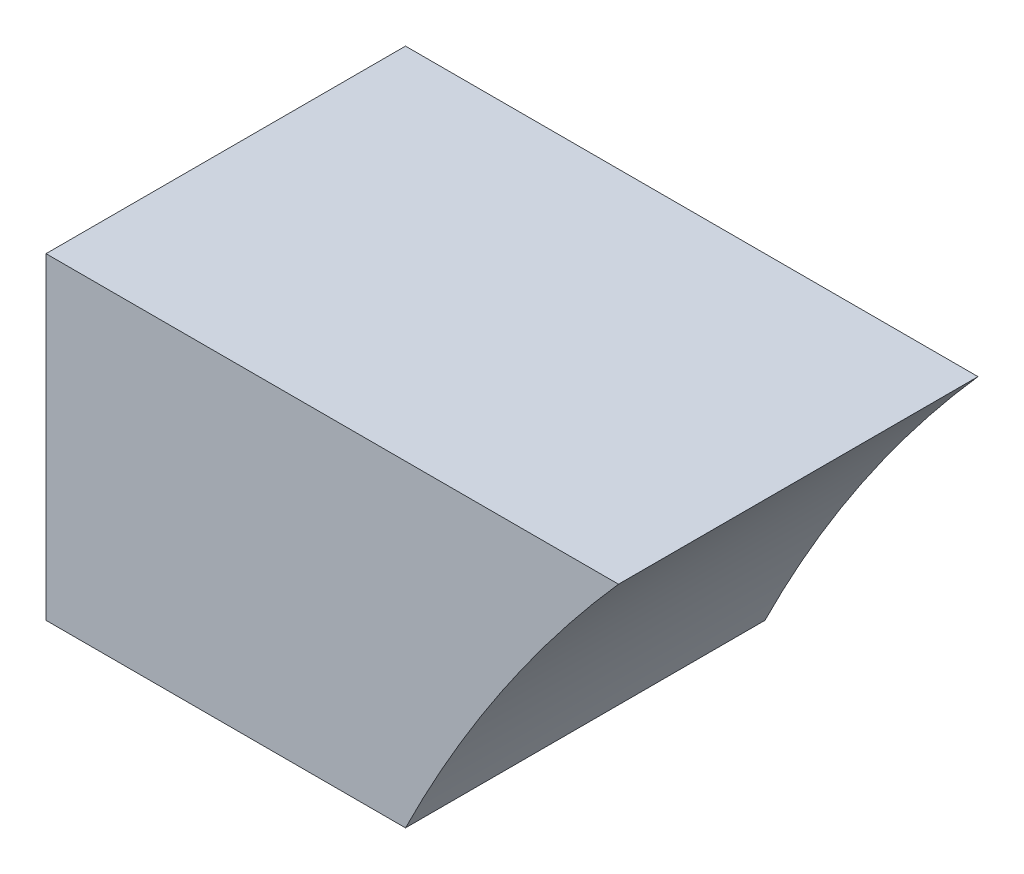
ISO-10303-21;
HEADER;
FILE_DESCRIPTION(('STEP AP214'),'2;1');
FILE_NAME('part.step','',(''),(''),'','','');
FILE_SCHEMA(('AUTOMOTIVE_DESIGN { 1 0 10303 214 1 1 1 1 }'));
ENDSEC;
DATA;
#1=APPLICATION_CONTEXT('core data for automotive mechanical design processes');
#2=APPLICATION_PROTOCOL_DEFINITION('international standard','automotive_design',2000,#1);
#3=PRODUCT_CONTEXT('',#1,'mechanical');
#4=PRODUCT('Part','Part','',(#3));
#5=PRODUCT_RELATED_PRODUCT_CATEGORY('part','',(#4));
#6=PRODUCT_DEFINITION_FORMATION('','',#4);
#7=PRODUCT_DEFINITION_CONTEXT('part definition',#1,'design');
#8=PRODUCT_DEFINITION('design','',#6,#7);
#9=PRODUCT_DEFINITION_SHAPE('','',#8);
#10=(LENGTH_UNIT() NAMED_UNIT(*) SI_UNIT(.MILLI.,.METRE.));
#11=(NAMED_UNIT(*) PLANE_ANGLE_UNIT() SI_UNIT($,.RADIAN.));
#12=(NAMED_UNIT(*) SI_UNIT($,.STERADIAN.) SOLID_ANGLE_UNIT());
#13=UNCERTAINTY_MEASURE_WITH_UNIT(LENGTH_MEASURE(1.E-05),#10,'distance_accuracy_value','');
#14=(GEOMETRIC_REPRESENTATION_CONTEXT(3) GLOBAL_UNCERTAINTY_ASSIGNED_CONTEXT((#13)) GLOBAL_UNIT_ASSIGNED_CONTEXT((#10,
#11,#12)) REPRESENTATION_CONTEXT('',''));
#15=CARTESIAN_POINT('',(0.,0.,0.));
#16=DIRECTION('',(0.,0.,1.));
#17=DIRECTION('',(1.,0.,0.));
#18=AXIS2_PLACEMENT_3D('',#15,#16,#17);
#19=CARTESIAN_POINT('',(-8112.,4992.,624.));
#20=DIRECTION('',(0.,0.,-1.));
#21=DIRECTION('',(-1.,0.,0.));
#22=AXIS2_PLACEMENT_3D('',#19,#20,#21);
#23=CYLINDRICAL_SURFACE('',#22,2496.);
#24=CARTESIAN_POINT('',(-8112.,4992.,0.));
#25=DIRECTION('',(0.,0.,1.));
#26=DIRECTION('',(1.,0.,0.));
#27=AXIS2_PLACEMENT_3D('',#24,#25,#26);
#28=CIRCLE('',#27,2496.);
#29=CARTESIAN_POINT('',(-9981.65853566901,6645.6,0.));
#30=VERTEX_POINT('',#29);
#31=CARTESIAN_POINT('',(-10351.3593369533,6094.4,0.));
#32=VERTEX_POINT('',#31);
#33=EDGE_CURVE('E100',#30,#32,#28,.T.);
#34=ORIENTED_EDGE('',*,*,#33,.F.);
#35=DIRECTION('',(0.,0.,-1.));
#36=VECTOR('',#35,1.);
#37=CARTESIAN_POINT('',(-9981.65853566901,6645.6,624.));
#38=LINE('',#37,#36);
#39=CARTESIAN_POINT('',(-9981.65853566901,6645.6,624.));
#40=VERTEX_POINT('',#39);
#41=EDGE_CURVE('E11',#40,#30,#38,.T.);
#42=ORIENTED_EDGE('',*,*,#41,.F.);
#43=CARTESIAN_POINT('',(-8112.,4992.,624.));
#44=DIRECTION('',(0.,0.,1.));
#45=DIRECTION('',(1.,0.,0.));
#46=AXIS2_PLACEMENT_3D('',#43,#44,#45);
#47=CIRCLE('',#46,2496.);
#48=CARTESIAN_POINT('',(-10351.3593369533,6094.4,624.));
#49=VERTEX_POINT('',#48);
#50=EDGE_CURVE('E93',#40,#49,#47,.T.);
#51=ORIENTED_EDGE('',*,*,#50,.T.);
#52=DIRECTION('',(0.,0.,-1.));
#53=VECTOR('',#52,1.);
#54=CARTESIAN_POINT('',(-10351.3593369533,6094.4,624.));
#55=LINE('',#54,#53);
#56=EDGE_CURVE('E75',#49,#32,#55,.T.);
#57=ORIENTED_EDGE('',*,*,#56,.T.);
#58=EDGE_LOOP('',(#34,#42,#51,#57));
#59=FACE_BOUND('',#58,.T.);
#60=ADVANCED_FACE('F37',(#59),#23,.F.);
#61=CARTESIAN_POINT('',(0.,6645.6,624.));
#62=DIRECTION('',(0.,1.,0.));
#63=DIRECTION('',(0.,0.,1.));
#64=AXIS2_PLACEMENT_3D('',#61,#62,#63);
#65=PLANE('',#64);
#66=DIRECTION('',(1.,0.,0.));
#67=VECTOR('',#66,1.);
#68=CARTESIAN_POINT('',(0.,6645.6,0.));
#69=LINE('',#68,#67);
#70=CARTESIAN_POINT('',(-10975.3593369533,6645.6,0.));
#71=VERTEX_POINT('',#70);
#72=EDGE_CURVE('E86',#71,#30,#69,.T.);
#73=ORIENTED_EDGE('',*,*,#72,.F.);
#74=DIRECTION('',(0.,0.,-1.));
#75=VECTOR('',#74,1.);
#76=CARTESIAN_POINT('',(-10975.3593369533,6645.6,624.));
#77=LINE('',#76,#75);
#78=CARTESIAN_POINT('',(-10975.3593369533,6645.6,624.));
#79=VERTEX_POINT('',#78);
#80=EDGE_CURVE('E45',#79,#71,#77,.T.);
#81=ORIENTED_EDGE('',*,*,#80,.F.);
#82=DIRECTION('',(1.,0.,0.));
#83=VECTOR('',#82,1.);
#84=CARTESIAN_POINT('',(0.,6645.6,624.));
#85=LINE('',#84,#83);
#86=EDGE_CURVE('E84',#79,#40,#85,.T.);
#87=ORIENTED_EDGE('',*,*,#86,.T.);
#88=ORIENTED_EDGE('',*,*,#41,.T.);
#89=EDGE_LOOP('',(#73,#81,#87,#88));
#90=FACE_BOUND('',#89,.T.);
#91=ADVANCED_FACE('F83',(#90),#65,.T.);
#92=CARTESIAN_POINT('',(-10975.3593369533,0.,624.));
#93=DIRECTION('',(-1.,0.,0.));
#94=DIRECTION('',(0.,0.,1.));
#95=AXIS2_PLACEMENT_3D('',#92,#93,#94);
#96=PLANE('',#95);
#97=DIRECTION('',(0.,1.,0.));
#98=VECTOR('',#97,1.);
#99=CARTESIAN_POINT('',(-10975.3593369533,0.,0.));
#100=LINE('',#99,#98);
#101=CARTESIAN_POINT('',(-10975.3593369533,6094.4,0.));
#102=VERTEX_POINT('',#101);
#103=EDGE_CURVE('E104',#102,#71,#100,.T.);
#104=ORIENTED_EDGE('',*,*,#103,.F.);
#105=DIRECTION('',(0.,0.,-1.));
#106=VECTOR('',#105,1.);
#107=CARTESIAN_POINT('',(-10975.3593369533,6094.4,624.));
#108=LINE('',#107,#106);
#109=CARTESIAN_POINT('',(-10975.3593369533,6094.4,624.));
#110=VERTEX_POINT('',#109);
#111=EDGE_CURVE('E68',#110,#102,#108,.T.);
#112=ORIENTED_EDGE('',*,*,#111,.F.);
#113=DIRECTION('',(0.,1.,0.));
#114=VECTOR('',#113,1.);
#115=CARTESIAN_POINT('',(-10975.3593369533,0.,624.));
#116=LINE('',#115,#114);
#117=EDGE_CURVE('E92',#110,#79,#116,.T.);
#118=ORIENTED_EDGE('',*,*,#117,.T.);
#119=ORIENTED_EDGE('',*,*,#80,.T.);
#120=EDGE_LOOP('',(#104,#112,#118,#119));
#121=FACE_BOUND('',#120,.T.);
#122=ADVANCED_FACE('F95',(#121),#96,.T.);
#123=CARTESIAN_POINT('',(0.,6094.4,624.));
#124=DIRECTION('',(0.,1.,0.));
#125=DIRECTION('',(0.,0.,1.));
#126=AXIS2_PLACEMENT_3D('',#123,#124,#125);
#127=PLANE('',#126);
#128=DIRECTION('',(1.,0.,0.));
#129=VECTOR('',#128,1.);
#130=CARTESIAN_POINT('',(0.,6094.4,0.));
#131=LINE('',#130,#129);
#132=EDGE_CURVE('E106',#102,#32,#131,.T.);
#133=ORIENTED_EDGE('',*,*,#132,.T.);
#134=ORIENTED_EDGE('',*,*,#56,.F.);
#135=DIRECTION('',(1.,0.,0.));
#136=VECTOR('',#135,1.);
#137=CARTESIAN_POINT('',(0.,6094.4,624.));
#138=LINE('',#137,#136);
#139=EDGE_CURVE('E53',#110,#49,#138,.T.);
#140=ORIENTED_EDGE('',*,*,#139,.F.);
#141=ORIENTED_EDGE('',*,*,#111,.T.);
#142=EDGE_LOOP('',(#133,#134,#140,#141));
#143=FACE_BOUND('',#142,.T.);
#144=ADVANCED_FACE('F116',(#143),#127,.F.);
#145=CARTESIAN_POINT('',(0.,0.,624.));
#146=DIRECTION('',(0.,0.,1.));
#147=DIRECTION('',(1.,0.,0.));
#148=AXIS2_PLACEMENT_3D('',#145,#146,#147);
#149=PLANE('',#148);
#150=ORIENTED_EDGE('',*,*,#50,.F.);
#151=ORIENTED_EDGE('',*,*,#86,.F.);
#152=ORIENTED_EDGE('',*,*,#117,.F.);
#153=ORIENTED_EDGE('',*,*,#139,.T.);
#154=EDGE_LOOP('',(#150,#151,#152,#153));
#155=FACE_BOUND('',#154,.T.);
#156=ADVANCED_FACE('F91',(#155),#149,.T.);
#157=CARTESIAN_POINT('',(0.,0.,0.));
#158=DIRECTION('',(0.,0.,1.));
#159=DIRECTION('',(1.,0.,0.));
#160=AXIS2_PLACEMENT_3D('',#157,#158,#159);
#161=PLANE('',#160);
#162=ORIENTED_EDGE('',*,*,#33,.T.);
#163=ORIENTED_EDGE('',*,*,#132,.F.);
#164=ORIENTED_EDGE('',*,*,#103,.T.);
#165=ORIENTED_EDGE('',*,*,#72,.T.);
#166=EDGE_LOOP('',(#162,#163,#164,#165));
#167=FACE_BOUND('',#166,.T.);
#168=ADVANCED_FACE('F121',(#167),#161,.F.);
#169=CLOSED_SHELL('',(#60,#91,#122,#144,#156,#168));
#170=MANIFOLD_SOLID_BREP('B2',#169);
#171=ADVANCED_BREP_SHAPE_REPRESENTATION('',(#18,#170),#14);
#172=SHAPE_DEFINITION_REPRESENTATION(#9,#171);
ENDSEC;
END-ISO-10303-21;
